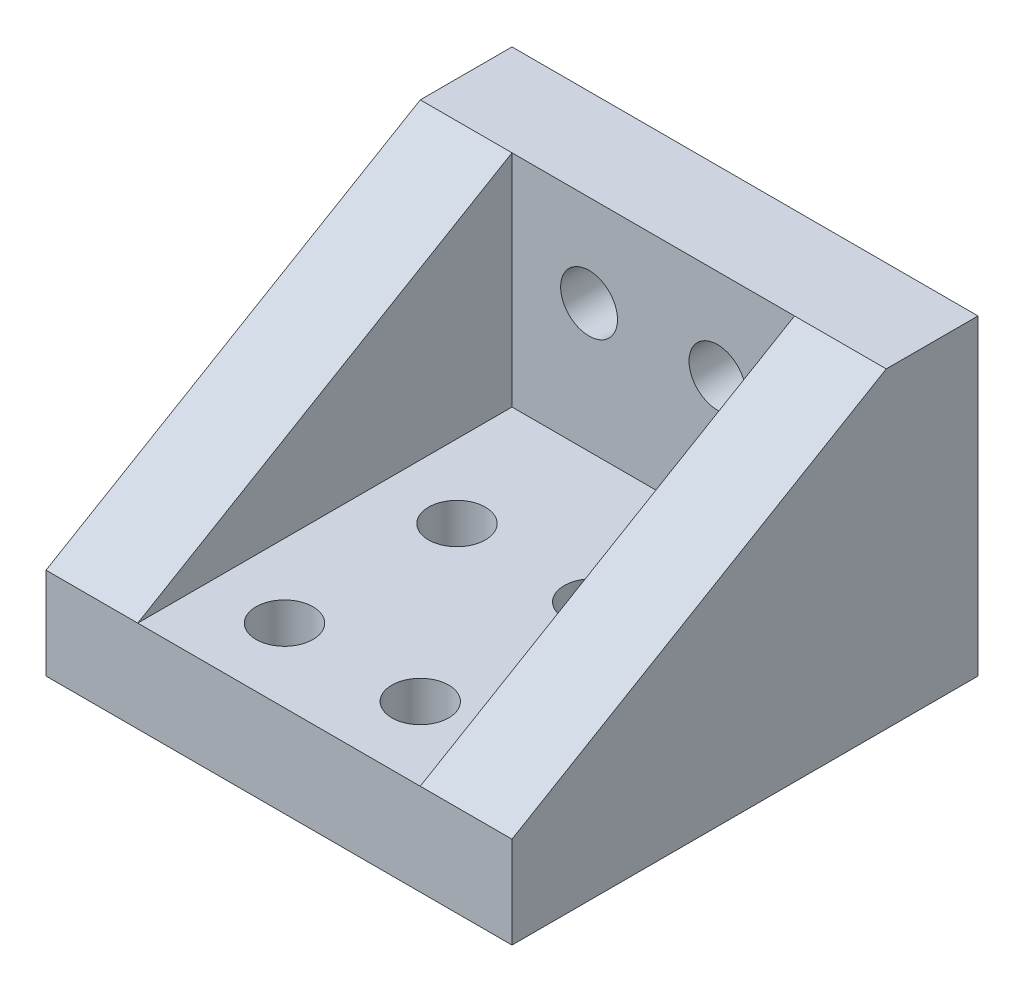
ISO-10303-21;
HEADER;
FILE_DESCRIPTION(('STEP AP214'),'2;1');
FILE_NAME('part.step','',(''),(''),'','','');
FILE_SCHEMA(('AUTOMOTIVE_DESIGN { 1 0 10303 214 1 1 1 1 }'));
ENDSEC;
DATA;
#1=APPLICATION_CONTEXT('core data for automotive mechanical design processes');
#2=APPLICATION_PROTOCOL_DEFINITION('international standard','automotive_design',2000,#1);
#3=PRODUCT_CONTEXT('',#1,'mechanical');
#4=PRODUCT('Part','Part','',(#3));
#5=PRODUCT_RELATED_PRODUCT_CATEGORY('part','',(#4));
#6=PRODUCT_DEFINITION_FORMATION('','',#4);
#7=PRODUCT_DEFINITION_CONTEXT('part definition',#1,'design');
#8=PRODUCT_DEFINITION('design','',#6,#7);
#9=PRODUCT_DEFINITION_SHAPE('','',#8);
#10=(LENGTH_UNIT() NAMED_UNIT(*) SI_UNIT(.MILLI.,.METRE.));
#11=(NAMED_UNIT(*) PLANE_ANGLE_UNIT() SI_UNIT($,.RADIAN.));
#12=(NAMED_UNIT(*) SI_UNIT($,.STERADIAN.) SOLID_ANGLE_UNIT());
#13=UNCERTAINTY_MEASURE_WITH_UNIT(LENGTH_MEASURE(1.E-05),#10,'distance_accuracy_value','');
#14=(GEOMETRIC_REPRESENTATION_CONTEXT(3) GLOBAL_UNCERTAINTY_ASSIGNED_CONTEXT((#13)) GLOBAL_UNIT_ASSIGNED_CONTEXT((#10,
#11,#12)) REPRESENTATION_CONTEXT('',''));
#15=CARTESIAN_POINT('',(0.,0.,0.));
#16=DIRECTION('',(0.,0.,1.));
#17=DIRECTION('',(1.,0.,0.));
#18=AXIS2_PLACEMENT_3D('',#15,#16,#17);
#19=CARTESIAN_POINT('',(25.4,5.,-20.4));
#20=DIRECTION('',(0.,0.,-1.));
#21=DIRECTION('',(-1.,0.,0.));
#22=AXIS2_PLACEMENT_3D('',#19,#20,#21);
#23=PLANE('',#22);
#24=CARTESIAN_POINT('',(16.2,12.,-20.4));
#25=DIRECTION('',(0.,0.,-1.));
#26=DIRECTION('',(-1.,0.,0.));
#27=AXIS2_PLACEMENT_3D('',#24,#25,#26);
#28=CIRCLE('',#27,1.55);
#29=CARTESIAN_POINT('',(14.65,12.,-20.4));
#30=VERTEX_POINT('',#29);
#31=EDGE_CURVE('E161',#30,#30,#28,.F.);
#32=ORIENTED_EDGE('',*,*,#31,.F.);
#33=EDGE_LOOP('',(#32));
#34=FACE_BOUND('',#33,.T.);
#35=CARTESIAN_POINT('',(9.2,12.,-20.4));
#36=DIRECTION('',(0.,0.,-1.));
#37=DIRECTION('',(-1.,0.,0.));
#38=AXIS2_PLACEMENT_3D('',#35,#36,#37);
#39=CIRCLE('',#38,1.55);
#40=CARTESIAN_POINT('',(7.65,12.,-20.4));
#41=VERTEX_POINT('',#40);
#42=EDGE_CURVE('E168',#41,#41,#39,.F.);
#43=ORIENTED_EDGE('',*,*,#42,.F.);
#44=EDGE_LOOP('',(#43));
#45=FACE_BOUND('',#44,.T.);
#46=DIRECTION('',(0.,-1.,0.));
#47=VECTOR('',#46,1.);
#48=CARTESIAN_POINT('',(20.4,5.,-20.4));
#49=LINE('',#48,#47);
#50=CARTESIAN_POINT('',(20.4,17.,-20.4));
#51=VERTEX_POINT('',#50);
#52=CARTESIAN_POINT('',(20.4,5.,-20.4));
#53=VERTEX_POINT('',#52);
#54=EDGE_CURVE('E203',#51,#53,#49,.T.);
#55=ORIENTED_EDGE('',*,*,#54,.F.);
#56=DIRECTION('',(-1.,0.,0.));
#57=VECTOR('',#56,1.);
#58=CARTESIAN_POINT('',(25.4,17.,-20.4));
#59=LINE('',#58,#57);
#60=CARTESIAN_POINT('',(5.,17.,-20.4));
#61=VERTEX_POINT('',#60);
#62=EDGE_CURVE('E55',#51,#61,#59,.T.);
#63=ORIENTED_EDGE('',*,*,#62,.T.);
#64=DIRECTION('',(0.,1.,0.));
#65=VECTOR('',#64,1.);
#66=CARTESIAN_POINT('',(5.,5.,-20.4));
#67=LINE('',#66,#65);
#68=CARTESIAN_POINT('',(5.,5.,-20.4));
#69=VERTEX_POINT('',#68);
#70=EDGE_CURVE('E177',#69,#61,#67,.T.);
#71=ORIENTED_EDGE('',*,*,#70,.F.);
#72=DIRECTION('',(-1.,0.,0.));
#73=VECTOR('',#72,1.);
#74=CARTESIAN_POINT('',(25.4,5.,-20.4));
#75=LINE('',#74,#73);
#76=EDGE_CURVE('E63',#53,#69,#75,.T.);
#77=ORIENTED_EDGE('',*,*,#76,.F.);
#78=EDGE_LOOP('',(#55,#63,#71,#77));
#79=FACE_BOUND('',#78,.T.);
#80=ADVANCED_FACE('F39',(#34,#45,#79),#23,.F.);
#81=CARTESIAN_POINT('',(25.4,5.,0.));
#82=DIRECTION('',(0.,-1.,0.));
#83=DIRECTION('',(0.,0.,-1.));
#84=AXIS2_PLACEMENT_3D('',#81,#82,#83);
#85=PLANE('',#84);
#86=CARTESIAN_POINT('',(16.4,5.,-4.));
#87=DIRECTION('',(0.,1.,0.));
#88=DIRECTION('',(0.,0.,1.));
#89=AXIS2_PLACEMENT_3D('',#86,#87,#88);
#90=CIRCLE('',#89,1.55);
#91=CARTESIAN_POINT('',(16.4,5.,-2.45));
#92=VERTEX_POINT('',#91);
#93=EDGE_CURVE('E227',#92,#92,#90,.T.);
#94=ORIENTED_EDGE('',*,*,#93,.F.);
#95=EDGE_LOOP('',(#94));
#96=FACE_BOUND('',#95,.T.);
#97=CARTESIAN_POINT('',(16.4,5.,-13.4));
#98=DIRECTION('',(0.,1.,0.));
#99=DIRECTION('',(0.,0.,1.));
#100=AXIS2_PLACEMENT_3D('',#97,#98,#99);
#101=CIRCLE('',#100,1.55);
#102=CARTESIAN_POINT('',(16.4,5.,-11.85));
#103=VERTEX_POINT('',#102);
#104=EDGE_CURVE('E226',#103,#103,#101,.T.);
#105=ORIENTED_EDGE('',*,*,#104,.F.);
#106=EDGE_LOOP('',(#105));
#107=FACE_BOUND('',#106,.T.);
#108=CARTESIAN_POINT('',(9.,5.,-13.4));
#109=DIRECTION('',(0.,1.,0.));
#110=DIRECTION('',(0.,0.,1.));
#111=AXIS2_PLACEMENT_3D('',#108,#109,#110);
#112=CIRCLE('',#111,1.55);
#113=CARTESIAN_POINT('',(9.,5.,-11.85));
#114=VERTEX_POINT('',#113);
#115=EDGE_CURVE('E235',#114,#114,#112,.T.);
#116=ORIENTED_EDGE('',*,*,#115,.F.);
#117=EDGE_LOOP('',(#116));
#118=FACE_BOUND('',#117,.T.);
#119=CARTESIAN_POINT('',(9.,5.,-4.));
#120=DIRECTION('',(0.,1.,0.));
#121=DIRECTION('',(0.,0.,1.));
#122=AXIS2_PLACEMENT_3D('',#119,#120,#121);
#123=CIRCLE('',#122,1.55);
#124=CARTESIAN_POINT('',(9.,5.,-2.45));
#125=VERTEX_POINT('',#124);
#126=EDGE_CURVE('E217',#125,#125,#123,.T.);
#127=ORIENTED_EDGE('',*,*,#126,.F.);
#128=EDGE_LOOP('',(#127));
#129=FACE_BOUND('',#128,.T.);
#130=DIRECTION('',(0.,0.,1.));
#131=VECTOR('',#130,1.);
#132=CARTESIAN_POINT('',(20.4,5.,0.));
#133=LINE('',#132,#131);
#134=CARTESIAN_POINT('',(20.4,5.,0.));
#135=VERTEX_POINT('',#134);
#136=EDGE_CURVE('E118',#53,#135,#133,.T.);
#137=ORIENTED_EDGE('',*,*,#136,.F.);
#138=ORIENTED_EDGE('',*,*,#76,.T.);
#139=DIRECTION('',(0.,0.,-1.));
#140=VECTOR('',#139,1.);
#141=CARTESIAN_POINT('',(5.,5.,0.));
#142=LINE('',#141,#140);
#143=CARTESIAN_POINT('',(5.,5.,0.));
#144=VERTEX_POINT('',#143);
#145=EDGE_CURVE('E187',#144,#69,#142,.T.);
#146=ORIENTED_EDGE('',*,*,#145,.F.);
#147=DIRECTION('',(-1.,0.,0.));
#148=VECTOR('',#147,1.);
#149=CARTESIAN_POINT('',(25.4,5.,0.));
#150=LINE('',#149,#148);
#151=EDGE_CURVE('E141',#135,#144,#150,.T.);
#152=ORIENTED_EDGE('',*,*,#151,.F.);
#153=EDGE_LOOP('',(#137,#138,#146,#152));
#154=FACE_BOUND('',#153,.T.);
#155=ADVANCED_FACE('F249',(#96,#107,#118,#129,#154),#85,.F.);
#156=CARTESIAN_POINT('',(25.4,0.,-25.4));
#157=DIRECTION('',(0.,1.,0.));
#158=DIRECTION('',(0.,0.,1.));
#159=AXIS2_PLACEMENT_3D('',#156,#157,#158);
#160=PLANE('',#159);
#161=CARTESIAN_POINT('',(16.4,0.,-4.));
#162=DIRECTION('',(0.,1.,0.));
#163=DIRECTION('',(0.,0.,1.));
#164=AXIS2_PLACEMENT_3D('',#161,#162,#163);
#165=CIRCLE('',#164,1.55);
#166=CARTESIAN_POINT('',(16.4,0.,-2.45));
#167=VERTEX_POINT('',#166);
#168=EDGE_CURVE('E222',#167,#167,#165,.F.);
#169=ORIENTED_EDGE('',*,*,#168,.F.);
#170=EDGE_LOOP('',(#169));
#171=FACE_BOUND('',#170,.T.);
#172=CARTESIAN_POINT('',(16.4,0.,-13.4));
#173=DIRECTION('',(0.,1.,0.));
#174=DIRECTION('',(0.,0.,1.));
#175=AXIS2_PLACEMENT_3D('',#172,#173,#174);
#176=CIRCLE('',#175,1.55);
#177=CARTESIAN_POINT('',(16.4,0.,-11.85));
#178=VERTEX_POINT('',#177);
#179=EDGE_CURVE('E231',#178,#178,#176,.F.);
#180=ORIENTED_EDGE('',*,*,#179,.F.);
#181=EDGE_LOOP('',(#180));
#182=FACE_BOUND('',#181,.T.);
#183=CARTESIAN_POINT('',(9.,0.,-13.4));
#184=DIRECTION('',(0.,1.,0.));
#185=DIRECTION('',(0.,0.,1.));
#186=AXIS2_PLACEMENT_3D('',#183,#184,#185);
#187=CIRCLE('',#186,1.55);
#188=CARTESIAN_POINT('',(9.,0.,-11.85));
#189=VERTEX_POINT('',#188);
#190=EDGE_CURVE('E221',#189,#189,#187,.F.);
#191=ORIENTED_EDGE('',*,*,#190,.F.);
#192=EDGE_LOOP('',(#191));
#193=FACE_BOUND('',#192,.T.);
#194=CARTESIAN_POINT('',(9.,0.,-4.));
#195=DIRECTION('',(0.,1.,0.));
#196=DIRECTION('',(0.,0.,1.));
#197=AXIS2_PLACEMENT_3D('',#194,#195,#196);
#198=CIRCLE('',#197,1.55);
#199=CARTESIAN_POINT('',(9.,0.,-2.45));
#200=VERTEX_POINT('',#199);
#201=EDGE_CURVE('E212',#200,#200,#198,.F.);
#202=ORIENTED_EDGE('',*,*,#201,.F.);
#203=EDGE_LOOP('',(#202));
#204=FACE_BOUND('',#203,.T.);
#205=DIRECTION('',(-1.,0.,0.));
#206=VECTOR('',#205,1.);
#207=CARTESIAN_POINT('',(25.4,0.,0.));
#208=LINE('',#207,#206);
#209=CARTESIAN_POINT('',(25.4,0.,0.));
#210=VERTEX_POINT('',#209);
#211=CARTESIAN_POINT('',(0.,0.,0.));
#212=VERTEX_POINT('',#211);
#213=EDGE_CURVE('E142',#210,#212,#208,.T.);
#214=ORIENTED_EDGE('',*,*,#213,.T.);
#215=DIRECTION('',(0.,0.,-1.));
#216=VECTOR('',#215,1.);
#217=CARTESIAN_POINT('',(0.,0.,-25.4));
#218=LINE('',#217,#216);
#219=CARTESIAN_POINT('',(0.,0.,-25.4));
#220=VERTEX_POINT('',#219);
#221=EDGE_CURVE('E157',#212,#220,#218,.T.);
#222=ORIENTED_EDGE('',*,*,#221,.T.);
#223=DIRECTION('',(-1.,0.,0.));
#224=VECTOR('',#223,1.);
#225=CARTESIAN_POINT('',(25.4,0.,-25.4));
#226=LINE('',#225,#224);
#227=CARTESIAN_POINT('',(25.4,0.,-25.4));
#228=VERTEX_POINT('',#227);
#229=EDGE_CURVE('E11',#228,#220,#226,.T.);
#230=ORIENTED_EDGE('',*,*,#229,.F.);
#231=DIRECTION('',(0.,0.,-1.));
#232=VECTOR('',#231,1.);
#233=CARTESIAN_POINT('',(25.4,0.,-25.4));
#234=LINE('',#233,#232);
#235=EDGE_CURVE('E149',#210,#228,#234,.T.);
#236=ORIENTED_EDGE('',*,*,#235,.F.);
#237=EDGE_LOOP('',(#214,#222,#230,#236));
#238=FACE_BOUND('',#237,.T.);
#239=ADVANCED_FACE('F41',(#171,#182,#193,#204,#238),#160,.F.);
#240=CARTESIAN_POINT('',(25.4,17.,-25.4));
#241=DIRECTION('',(0.,0.,1.));
#242=DIRECTION('',(0.,-1.,0.));
#243=AXIS2_PLACEMENT_3D('',#240,#241,#242);
#244=PLANE('',#243);
#245=ORIENTED_EDGE('',*,*,#229,.T.);
#246=DIRECTION('',(0.,1.,0.));
#247=VECTOR('',#246,1.);
#248=CARTESIAN_POINT('',(0.,17.,-25.4));
#249=LINE('',#248,#247);
#250=CARTESIAN_POINT('',(0.,17.,-25.4));
#251=VERTEX_POINT('',#250);
#252=EDGE_CURVE('E153',#220,#251,#249,.T.);
#253=ORIENTED_EDGE('',*,*,#252,.T.);
#254=DIRECTION('',(-1.,0.,0.));
#255=VECTOR('',#254,1.);
#256=CARTESIAN_POINT('',(25.4,17.,-25.4));
#257=LINE('',#256,#255);
#258=CARTESIAN_POINT('',(25.4,17.,-25.4));
#259=VERTEX_POINT('',#258);
#260=EDGE_CURVE('E48',#259,#251,#257,.T.);
#261=ORIENTED_EDGE('',*,*,#260,.F.);
#262=DIRECTION('',(0.,1.,0.));
#263=VECTOR('',#262,1.);
#264=CARTESIAN_POINT('',(25.4,17.,-25.4));
#265=LINE('',#264,#263);
#266=EDGE_CURVE('E125',#228,#259,#265,.T.);
#267=ORIENTED_EDGE('',*,*,#266,.F.);
#268=EDGE_LOOP('',(#245,#253,#261,#267));
#269=FACE_BOUND('',#268,.T.);
#270=CARTESIAN_POINT('',(16.2,12.,-25.4));
#271=DIRECTION('',(0.,0.,-1.));
#272=DIRECTION('',(0.,1.,0.));
#273=AXIS2_PLACEMENT_3D('',#270,#271,#272);
#274=CIRCLE('',#273,1.55);
#275=CARTESIAN_POINT('',(16.2,13.55,-25.4));
#276=VERTEX_POINT('',#275);
#277=EDGE_CURVE('E172',#276,#276,#274,.T.);
#278=ORIENTED_EDGE('',*,*,#277,.F.);
#279=EDGE_LOOP('',(#278));
#280=FACE_BOUND('',#279,.T.);
#281=CARTESIAN_POINT('',(9.2,12.,-25.4));
#282=DIRECTION('',(0.,0.,-1.));
#283=DIRECTION('',(0.,1.,0.));
#284=AXIS2_PLACEMENT_3D('',#281,#282,#283);
#285=CIRCLE('',#284,1.55);
#286=CARTESIAN_POINT('',(9.2,13.55,-25.4));
#287=VERTEX_POINT('',#286);
#288=EDGE_CURVE('E173',#287,#287,#285,.T.);
#289=ORIENTED_EDGE('',*,*,#288,.F.);
#290=EDGE_LOOP('',(#289));
#291=FACE_BOUND('',#290,.T.);
#292=ADVANCED_FACE('F277',(#269,#280,#291),#244,.F.);
#293=CARTESIAN_POINT('',(25.4,17.,-20.4));
#294=DIRECTION('',(0.,-1.,0.));
#295=DIRECTION('',(0.,0.,-1.));
#296=AXIS2_PLACEMENT_3D('',#293,#294,#295);
#297=PLANE('',#296);
#298=ORIENTED_EDGE('',*,*,#260,.T.);
#299=DIRECTION('',(0.,0.,1.));
#300=VECTOR('',#299,1.);
#301=CARTESIAN_POINT('',(0.,17.,-20.4));
#302=LINE('',#301,#300);
#303=CARTESIAN_POINT('',(0.,17.,-20.4));
#304=VERTEX_POINT('',#303);
#305=EDGE_CURVE('E150',#251,#304,#302,.T.);
#306=ORIENTED_EDGE('',*,*,#305,.T.);
#307=DIRECTION('',(-1.,0.,0.));
#308=VECTOR('',#307,1.);
#309=CARTESIAN_POINT('',(25.4,17.,-20.4));
#310=LINE('',#309,#308);
#311=EDGE_CURVE('E191',#304,#61,#310,.F.);
#312=ORIENTED_EDGE('',*,*,#311,.T.);
#313=ORIENTED_EDGE('',*,*,#62,.F.);
#314=CARTESIAN_POINT('',(25.4,17.,-20.4));
#315=VERTEX_POINT('',#314);
#316=EDGE_CURVE('E111',#315,#51,#59,.T.);
#317=ORIENTED_EDGE('',*,*,#316,.F.);
#318=DIRECTION('',(0.,0.,1.));
#319=VECTOR('',#318,1.);
#320=CARTESIAN_POINT('',(25.4,17.,-20.4));
#321=LINE('',#320,#319);
#322=EDGE_CURVE('E122',#259,#315,#321,.T.);
#323=ORIENTED_EDGE('',*,*,#322,.F.);
#324=EDGE_LOOP('',(#298,#306,#312,#313,#317,#323));
#325=FACE_BOUND('',#324,.T.);
#326=ADVANCED_FACE('F131',(#325),#297,.F.);
#327=CARTESIAN_POINT('',(25.4,0.,0.));
#328=DIRECTION('',(0.,0.,-1.));
#329=DIRECTION('',(-1.,0.,0.));
#330=AXIS2_PLACEMENT_3D('',#327,#328,#329);
#331=PLANE('',#330);
#332=CARTESIAN_POINT('',(25.4,5.,0.));
#333=VERTEX_POINT('',#332);
#334=EDGE_CURVE('E114',#333,#135,#150,.T.);
#335=ORIENTED_EDGE('',*,*,#334,.T.);
#336=ORIENTED_EDGE('',*,*,#151,.T.);
#337=DIRECTION('',(-1.,0.,0.));
#338=VECTOR('',#337,1.);
#339=CARTESIAN_POINT('',(25.4,5.,0.));
#340=LINE('',#339,#338);
#341=CARTESIAN_POINT('',(0.,5.,0.));
#342=VERTEX_POINT('',#341);
#343=EDGE_CURVE('E194',#342,#144,#340,.F.);
#344=ORIENTED_EDGE('',*,*,#343,.F.);
#345=DIRECTION('',(0.,-1.,0.));
#346=VECTOR('',#345,1.);
#347=CARTESIAN_POINT('',(0.,0.,0.));
#348=LINE('',#347,#346);
#349=EDGE_CURVE('E145',#342,#212,#348,.T.);
#350=ORIENTED_EDGE('',*,*,#349,.T.);
#351=ORIENTED_EDGE('',*,*,#213,.F.);
#352=DIRECTION('',(0.,-1.,0.));
#353=VECTOR('',#352,1.);
#354=CARTESIAN_POINT('',(25.4,0.,0.));
#355=LINE('',#354,#353);
#356=EDGE_CURVE('E129',#333,#210,#355,.T.);
#357=ORIENTED_EDGE('',*,*,#356,.F.);
#358=EDGE_LOOP('',(#335,#336,#344,#350,#351,#357));
#359=FACE_BOUND('',#358,.T.);
#360=ADVANCED_FACE('F266',(#359),#331,.F.);
#361=CARTESIAN_POINT('',(25.4,0.,0.));
#362=DIRECTION('',(-1.,0.,0.));
#363=DIRECTION('',(0.,0.,1.));
#364=AXIS2_PLACEMENT_3D('',#361,#362,#363);
#365=PLANE('',#364);
#366=ORIENTED_EDGE('',*,*,#235,.T.);
#367=ORIENTED_EDGE('',*,*,#266,.T.);
#368=ORIENTED_EDGE('',*,*,#322,.T.);
#369=DIRECTION('',(0.,-0.507020126563394,0.861934215157769));
#370=VECTOR('',#369,1.);
#371=CARTESIAN_POINT('',(25.4,17.,-20.4));
#372=LINE('',#371,#370);
#373=EDGE_CURVE('E106',#315,#333,#372,.T.);
#374=ORIENTED_EDGE('',*,*,#373,.T.);
#375=ORIENTED_EDGE('',*,*,#356,.T.);
#376=EDGE_LOOP('',(#366,#367,#368,#374,#375));
#377=FACE_BOUND('',#376,.T.);
#378=ADVANCED_FACE('F124',(#377),#365,.F.);
#379=CARTESIAN_POINT('',(0.,0.,0.));
#380=DIRECTION('',(-1.,0.,0.));
#381=DIRECTION('',(0.,0.,1.));
#382=AXIS2_PLACEMENT_3D('',#379,#380,#381);
#383=PLANE('',#382);
#384=ORIENTED_EDGE('',*,*,#349,.F.);
#385=DIRECTION('',(0.,-0.507020126563394,0.861934215157769));
#386=VECTOR('',#385,1.);
#387=CARTESIAN_POINT('',(0.,17.,-20.4));
#388=LINE('',#387,#386);
#389=EDGE_CURVE('E198',#304,#342,#388,.T.);
#390=ORIENTED_EDGE('',*,*,#389,.F.);
#391=ORIENTED_EDGE('',*,*,#305,.F.);
#392=ORIENTED_EDGE('',*,*,#252,.F.);
#393=ORIENTED_EDGE('',*,*,#221,.F.);
#394=EDGE_LOOP('',(#384,#390,#391,#392,#393));
#395=FACE_BOUND('',#394,.T.);
#396=ADVANCED_FACE('F270',(#395),#383,.T.);
#397=CARTESIAN_POINT('',(9.2,12.,0.00100000000000447));
#398=DIRECTION('',(0.,0.,-1.));
#399=DIRECTION('',(0.,1.,0.));
#400=AXIS2_PLACEMENT_3D('',#397,#398,#399);
#401=CYLINDRICAL_SURFACE('',#400,1.55);
#402=ORIENTED_EDGE('',*,*,#288,.T.);
#403=EDGE_LOOP('',(#402));
#404=FACE_BOUND('',#403,.T.);
#405=ORIENTED_EDGE('',*,*,#42,.T.);
#406=EDGE_LOOP('',(#405));
#407=FACE_BOUND('',#406,.T.);
#408=ADVANCED_FACE('F284',(#404,#407),#401,.F.);
#409=CARTESIAN_POINT('',(16.2,12.,0.00100000000000447));
#410=DIRECTION('',(0.,0.,-1.));
#411=DIRECTION('',(0.,1.,0.));
#412=AXIS2_PLACEMENT_3D('',#409,#410,#411);
#413=CYLINDRICAL_SURFACE('',#412,1.55);
#414=ORIENTED_EDGE('',*,*,#277,.T.);
#415=EDGE_LOOP('',(#414));
#416=FACE_BOUND('',#415,.T.);
#417=ORIENTED_EDGE('',*,*,#31,.T.);
#418=EDGE_LOOP('',(#417));
#419=FACE_BOUND('',#418,.T.);
#420=ADVANCED_FACE('F287',(#416,#419),#413,.F.);
#421=CARTESIAN_POINT('',(5.,8.5,-12.7));
#422=DIRECTION('',(-1.,0.,0.));
#423=DIRECTION('',(0.,0.,1.));
#424=AXIS2_PLACEMENT_3D('',#421,#422,#423);
#425=PLANE('',#424);
#426=ORIENTED_EDGE('',*,*,#145,.T.);
#427=ORIENTED_EDGE('',*,*,#70,.T.);
#428=DIRECTION('',(0.,-0.507020126563394,0.861934215157769));
#429=VECTOR('',#428,1.);
#430=CARTESIAN_POINT('',(5.,17.,-20.4));
#431=LINE('',#430,#429);
#432=EDGE_CURVE('E199',#61,#144,#431,.T.);
#433=ORIENTED_EDGE('',*,*,#432,.T.);
#434=EDGE_LOOP('',(#426,#427,#433));
#435=FACE_BOUND('',#434,.T.);
#436=ADVANCED_FACE('F259',(#435),#425,.F.);
#437=CARTESIAN_POINT('',(0.,17.,-20.4));
#438=DIRECTION('',(0.,-0.861934215157769,-0.507020126563394));
#439=DIRECTION('',(0.,-0.507020126563394,0.861934215157769));
#440=AXIS2_PLACEMENT_3D('',#437,#438,#439);
#441=PLANE('',#440);
#442=ORIENTED_EDGE('',*,*,#311,.F.);
#443=ORIENTED_EDGE('',*,*,#389,.T.);
#444=ORIENTED_EDGE('',*,*,#343,.T.);
#445=ORIENTED_EDGE('',*,*,#432,.F.);
#446=EDGE_LOOP('',(#442,#443,#444,#445));
#447=FACE_BOUND('',#446,.T.);
#448=ADVANCED_FACE('F262',(#447),#441,.F.);
#449=CARTESIAN_POINT('',(20.4,8.5,-12.7));
#450=DIRECTION('',(1.,0.,0.));
#451=DIRECTION('',(0.,0.,-1.));
#452=AXIS2_PLACEMENT_3D('',#449,#450,#451);
#453=PLANE('',#452);
#454=DIRECTION('',(0.,-0.507020126563394,0.861934215157769));
#455=VECTOR('',#454,1.);
#456=CARTESIAN_POINT('',(20.4,17.,-20.4));
#457=LINE('',#456,#455);
#458=EDGE_CURVE('E119',#51,#135,#457,.T.);
#459=ORIENTED_EDGE('',*,*,#458,.F.);
#460=ORIENTED_EDGE('',*,*,#54,.T.);
#461=ORIENTED_EDGE('',*,*,#136,.T.);
#462=EDGE_LOOP('',(#459,#460,#461));
#463=FACE_BOUND('',#462,.T.);
#464=ADVANCED_FACE('F315',(#463),#453,.F.);
#465=CARTESIAN_POINT('',(25.4,17.,-20.4));
#466=DIRECTION('',(0.,0.861934215157769,0.507020126563394));
#467=DIRECTION('',(0.,-0.507020126563394,0.861934215157769));
#468=AXIS2_PLACEMENT_3D('',#465,#466,#467);
#469=PLANE('',#468);
#470=ORIENTED_EDGE('',*,*,#373,.F.);
#471=ORIENTED_EDGE('',*,*,#316,.T.);
#472=ORIENTED_EDGE('',*,*,#458,.T.);
#473=ORIENTED_EDGE('',*,*,#334,.F.);
#474=EDGE_LOOP('',(#470,#471,#472,#473));
#475=FACE_BOUND('',#474,.T.);
#476=ADVANCED_FACE('F108',(#475),#469,.T.);
#477=CARTESIAN_POINT('',(9.,-0.00100000000000013,-4.));
#478=DIRECTION('',(0.,1.,0.));
#479=DIRECTION('',(0.,0.,1.));
#480=AXIS2_PLACEMENT_3D('',#477,#478,#479);
#481=CYLINDRICAL_SURFACE('',#480,1.55);
#482=ORIENTED_EDGE('',*,*,#126,.T.);
#483=EDGE_LOOP('',(#482));
#484=FACE_BOUND('',#483,.T.);
#485=ORIENTED_EDGE('',*,*,#201,.T.);
#486=EDGE_LOOP('',(#485));
#487=FACE_BOUND('',#486,.T.);
#488=ADVANCED_FACE('F320',(#484,#487),#481,.F.);
#489=CARTESIAN_POINT('',(9.,-0.00100000000000013,-13.4));
#490=DIRECTION('',(0.,1.,0.));
#491=DIRECTION('',(0.,0.,1.));
#492=AXIS2_PLACEMENT_3D('',#489,#490,#491);
#493=CYLINDRICAL_SURFACE('',#492,1.55);
#494=ORIENTED_EDGE('',*,*,#115,.T.);
#495=EDGE_LOOP('',(#494));
#496=FACE_BOUND('',#495,.T.);
#497=ORIENTED_EDGE('',*,*,#190,.T.);
#498=EDGE_LOOP('',(#497));
#499=FACE_BOUND('',#498,.T.);
#500=ADVANCED_FACE('F246',(#496,#499),#493,.F.);
#501=CARTESIAN_POINT('',(16.4,-0.00100000000000013,-13.4));
#502=DIRECTION('',(0.,1.,0.));
#503=DIRECTION('',(0.,0.,1.));
#504=AXIS2_PLACEMENT_3D('',#501,#502,#503);
#505=CYLINDRICAL_SURFACE('',#504,1.55);
#506=ORIENTED_EDGE('',*,*,#104,.T.);
#507=EDGE_LOOP('',(#506));
#508=FACE_BOUND('',#507,.T.);
#509=ORIENTED_EDGE('',*,*,#179,.T.);
#510=EDGE_LOOP('',(#509));
#511=FACE_BOUND('',#510,.T.);
#512=ADVANCED_FACE('F329',(#508,#511),#505,.F.);
#513=CARTESIAN_POINT('',(16.4,-0.00100000000000013,-4.));
#514=DIRECTION('',(0.,1.,0.));
#515=DIRECTION('',(0.,0.,1.));
#516=AXIS2_PLACEMENT_3D('',#513,#514,#515);
#517=CYLINDRICAL_SURFACE('',#516,1.55);
#518=ORIENTED_EDGE('',*,*,#93,.T.);
#519=EDGE_LOOP('',(#518));
#520=FACE_BOUND('',#519,.T.);
#521=ORIENTED_EDGE('',*,*,#168,.T.);
#522=EDGE_LOOP('',(#521));
#523=FACE_BOUND('',#522,.T.);
#524=ADVANCED_FACE('F326',(#520,#523),#517,.F.);
#525=CLOSED_SHELL('',(#80,#155,#239,#292,#326,#360,#378,#396,#408,#420,#436,#448,#464,#476,#488,
#500,#512,#524));
#526=MANIFOLD_SOLID_BREP('B2',#525);
#527=ADVANCED_BREP_SHAPE_REPRESENTATION('',(#18,#526),#14);
#528=SHAPE_DEFINITION_REPRESENTATION(#9,#527);
ENDSEC;
END-ISO-10303-21;
